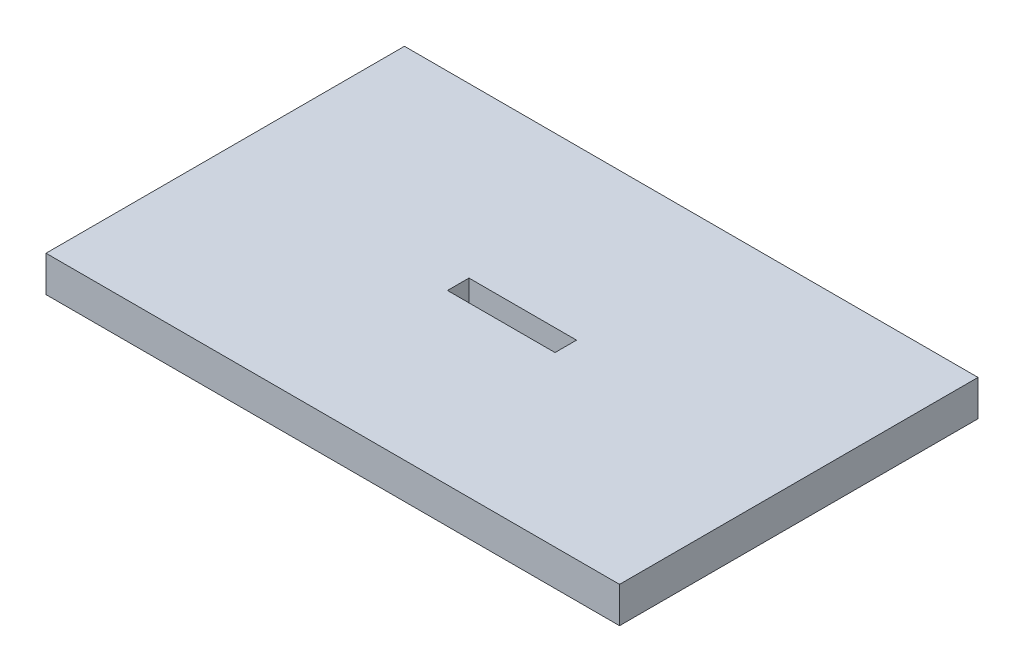
ISO-10303-21;
HEADER;
FILE_DESCRIPTION(('STEP AP214'),'2;1');
FILE_NAME('part.step','',(''),(''),'','','');
FILE_SCHEMA(('AUTOMOTIVE_DESIGN { 1 0 10303 214 1 1 1 1 }'));
ENDSEC;
DATA;
#1=APPLICATION_CONTEXT('core data for automotive mechanical design processes');
#2=APPLICATION_PROTOCOL_DEFINITION('international standard','automotive_design',2000,#1);
#3=PRODUCT_CONTEXT('',#1,'mechanical');
#4=PRODUCT('Part','Part','',(#3));
#5=PRODUCT_RELATED_PRODUCT_CATEGORY('part','',(#4));
#6=PRODUCT_DEFINITION_FORMATION('','',#4);
#7=PRODUCT_DEFINITION_CONTEXT('part definition',#1,'design');
#8=PRODUCT_DEFINITION('design','',#6,#7);
#9=PRODUCT_DEFINITION_SHAPE('','',#8);
#10=(LENGTH_UNIT() NAMED_UNIT(*) SI_UNIT(.MILLI.,.METRE.));
#11=(NAMED_UNIT(*) PLANE_ANGLE_UNIT() SI_UNIT($,.RADIAN.));
#12=(NAMED_UNIT(*) SI_UNIT($,.STERADIAN.) SOLID_ANGLE_UNIT());
#13=UNCERTAINTY_MEASURE_WITH_UNIT(LENGTH_MEASURE(1.E-05),#10,'distance_accuracy_value','');
#14=(GEOMETRIC_REPRESENTATION_CONTEXT(3) GLOBAL_UNCERTAINTY_ASSIGNED_CONTEXT((#13)) GLOBAL_UNIT_ASSIGNED_CONTEXT((#10,
#11,#12)) REPRESENTATION_CONTEXT('',''));
#15=CARTESIAN_POINT('',(0.,0.,0.));
#16=DIRECTION('',(0.,0.,1.));
#17=DIRECTION('',(1.,0.,0.));
#18=AXIS2_PLACEMENT_3D('',#15,#16,#17);
#19=CARTESIAN_POINT('',(0.,10.,0.));
#20=DIRECTION('',(0.,-1.,0.));
#21=DIRECTION('',(0.,0.,-1.));
#22=AXIS2_PLACEMENT_3D('',#19,#20,#21);
#23=PLANE('',#22);
#24=DIRECTION('',(0.,0.,-1.));
#25=VECTOR('',#24,1.);
#26=CARTESIAN_POINT('',(80.,10.,50.));
#27=LINE('',#26,#25);
#28=CARTESIAN_POINT('',(80.,10.,50.));
#29=VERTEX_POINT('',#28);
#30=CARTESIAN_POINT('',(80.,10.,-50.));
#31=VERTEX_POINT('',#30);
#32=EDGE_CURVE('E135',#29,#31,#27,.T.);
#33=ORIENTED_EDGE('',*,*,#32,.T.);
#34=DIRECTION('',(-1.,0.,0.));
#35=VECTOR('',#34,1.);
#36=CARTESIAN_POINT('',(-80.,10.,-50.));
#37=LINE('',#36,#35);
#38=CARTESIAN_POINT('',(-80.,10.,-50.));
#39=VERTEX_POINT('',#38);
#40=EDGE_CURVE('E138',#31,#39,#37,.T.);
#41=ORIENTED_EDGE('',*,*,#40,.T.);
#42=DIRECTION('',(0.,0.,1.));
#43=VECTOR('',#42,1.);
#44=CARTESIAN_POINT('',(-80.,10.,50.));
#45=LINE('',#44,#43);
#46=CARTESIAN_POINT('',(-80.,10.,50.));
#47=VERTEX_POINT('',#46);
#48=EDGE_CURVE('E141',#39,#47,#45,.T.);
#49=ORIENTED_EDGE('',*,*,#48,.T.);
#50=DIRECTION('',(1.,0.,0.));
#51=VECTOR('',#50,1.);
#52=CARTESIAN_POINT('',(-80.,10.,50.));
#53=LINE('',#52,#51);
#54=EDGE_CURVE('E143',#47,#29,#53,.T.);
#55=ORIENTED_EDGE('',*,*,#54,.T.);
#56=EDGE_LOOP('',(#33,#41,#49,#55));
#57=FACE_BOUND('',#56,.T.);
#58=DIRECTION('',(0.,0.,-1.));
#59=VECTOR('',#58,1.);
#60=CARTESIAN_POINT('',(15.,10.,3.));
#61=LINE('',#60,#59);
#62=CARTESIAN_POINT('',(15.,10.,3.));
#63=VERTEX_POINT('',#62);
#64=CARTESIAN_POINT('',(15.,10.,-3.));
#65=VERTEX_POINT('',#64);
#66=EDGE_CURVE('E99',#63,#65,#61,.T.);
#67=ORIENTED_EDGE('',*,*,#66,.F.);
#68=DIRECTION('',(1.,0.,0.));
#69=VECTOR('',#68,1.);
#70=CARTESIAN_POINT('',(-15.,10.,3.));
#71=LINE('',#70,#69);
#72=CARTESIAN_POINT('',(-15.,10.,3.));
#73=VERTEX_POINT('',#72);
#74=EDGE_CURVE('E121',#73,#63,#71,.T.);
#75=ORIENTED_EDGE('',*,*,#74,.F.);
#76=DIRECTION('',(0.,0.,1.));
#77=VECTOR('',#76,1.);
#78=CARTESIAN_POINT('',(-15.,10.,3.));
#79=LINE('',#78,#77);
#80=CARTESIAN_POINT('',(-15.,10.,-3.));
#81=VERTEX_POINT('',#80);
#82=EDGE_CURVE('E119',#81,#73,#79,.T.);
#83=ORIENTED_EDGE('',*,*,#82,.F.);
#84=DIRECTION('',(-1.,0.,0.));
#85=VECTOR('',#84,1.);
#86=CARTESIAN_POINT('',(-15.,10.,-3.));
#87=LINE('',#86,#85);
#88=EDGE_CURVE('E107',#65,#81,#87,.T.);
#89=ORIENTED_EDGE('',*,*,#88,.F.);
#90=EDGE_LOOP('',(#67,#75,#83,#89));
#91=FACE_BOUND('',#90,.T.);
#92=ADVANCED_FACE('F34',(#57,#91),#23,.F.);
#93=CARTESIAN_POINT('',(0.,0.,0.));
#94=DIRECTION('',(0.,-1.,0.));
#95=DIRECTION('',(0.,0.,-1.));
#96=AXIS2_PLACEMENT_3D('',#93,#94,#95);
#97=PLANE('',#96);
#98=DIRECTION('',(0.,0.,-1.));
#99=VECTOR('',#98,1.);
#100=CARTESIAN_POINT('',(80.,0.,50.));
#101=LINE('',#100,#99);
#102=CARTESIAN_POINT('',(80.,0.,50.));
#103=VERTEX_POINT('',#102);
#104=CARTESIAN_POINT('',(80.,0.,-50.));
#105=VERTEX_POINT('',#104);
#106=EDGE_CURVE('E115',#103,#105,#101,.T.);
#107=ORIENTED_EDGE('',*,*,#106,.F.);
#108=DIRECTION('',(1.,0.,0.));
#109=VECTOR('',#108,1.);
#110=CARTESIAN_POINT('',(-80.,0.,50.));
#111=LINE('',#110,#109);
#112=CARTESIAN_POINT('',(-80.,0.,50.));
#113=VERTEX_POINT('',#112);
#114=EDGE_CURVE('E139',#113,#103,#111,.T.);
#115=ORIENTED_EDGE('',*,*,#114,.F.);
#116=DIRECTION('',(0.,0.,1.));
#117=VECTOR('',#116,1.);
#118=CARTESIAN_POINT('',(-80.,0.,50.));
#119=LINE('',#118,#117);
#120=CARTESIAN_POINT('',(-80.,0.,-50.));
#121=VERTEX_POINT('',#120);
#122=EDGE_CURVE('E150',#121,#113,#119,.T.);
#123=ORIENTED_EDGE('',*,*,#122,.F.);
#124=DIRECTION('',(-1.,0.,0.));
#125=VECTOR('',#124,1.);
#126=CARTESIAN_POINT('',(-80.,0.,-50.));
#127=LINE('',#126,#125);
#128=EDGE_CURVE('E148',#105,#121,#127,.T.);
#129=ORIENTED_EDGE('',*,*,#128,.F.);
#130=EDGE_LOOP('',(#107,#115,#123,#129));
#131=FACE_BOUND('',#130,.T.);
#132=DIRECTION('',(1.,0.,0.));
#133=VECTOR('',#132,1.);
#134=CARTESIAN_POINT('',(-15.,0.,3.));
#135=LINE('',#134,#133);
#136=CARTESIAN_POINT('',(-15.,0.,3.));
#137=VERTEX_POINT('',#136);
#138=CARTESIAN_POINT('',(15.,0.,3.));
#139=VERTEX_POINT('',#138);
#140=EDGE_CURVE('E108',#137,#139,#135,.T.);
#141=ORIENTED_EDGE('',*,*,#140,.T.);
#142=DIRECTION('',(0.,0.,-1.));
#143=VECTOR('',#142,1.);
#144=CARTESIAN_POINT('',(15.,0.,3.));
#145=LINE('',#144,#143);
#146=CARTESIAN_POINT('',(15.,0.,-3.));
#147=VERTEX_POINT('',#146);
#148=EDGE_CURVE('E57',#139,#147,#145,.T.);
#149=ORIENTED_EDGE('',*,*,#148,.T.);
#150=DIRECTION('',(-1.,0.,0.));
#151=VECTOR('',#150,1.);
#152=CARTESIAN_POINT('',(-15.,0.,-3.));
#153=LINE('',#152,#151);
#154=CARTESIAN_POINT('',(-15.,0.,-3.));
#155=VERTEX_POINT('',#154);
#156=EDGE_CURVE('E114',#147,#155,#153,.T.);
#157=ORIENTED_EDGE('',*,*,#156,.T.);
#158=DIRECTION('',(0.,0.,1.));
#159=VECTOR('',#158,1.);
#160=CARTESIAN_POINT('',(-15.,0.,3.));
#161=LINE('',#160,#159);
#162=EDGE_CURVE('E127',#155,#137,#161,.T.);
#163=ORIENTED_EDGE('',*,*,#162,.T.);
#164=EDGE_LOOP('',(#141,#149,#157,#163));
#165=FACE_BOUND('',#164,.T.);
#166=ADVANCED_FACE('F168',(#131,#165),#97,.T.);
#167=CARTESIAN_POINT('',(80.,10.,50.));
#168=DIRECTION('',(-1.,0.,0.));
#169=DIRECTION('',(0.,0.,1.));
#170=AXIS2_PLACEMENT_3D('',#167,#168,#169);
#171=PLANE('',#170);
#172=ORIENTED_EDGE('',*,*,#106,.T.);
#173=DIRECTION('',(0.,-1.,0.));
#174=VECTOR('',#173,1.);
#175=CARTESIAN_POINT('',(80.,10.,-50.));
#176=LINE('',#175,#174);
#177=EDGE_CURVE('E11',#31,#105,#176,.T.);
#178=ORIENTED_EDGE('',*,*,#177,.F.);
#179=ORIENTED_EDGE('',*,*,#32,.F.);
#180=DIRECTION('',(0.,-1.,0.));
#181=VECTOR('',#180,1.);
#182=CARTESIAN_POINT('',(80.,10.,50.));
#183=LINE('',#182,#181);
#184=EDGE_CURVE('E145',#29,#103,#183,.T.);
#185=ORIENTED_EDGE('',*,*,#184,.T.);
#186=EDGE_LOOP('',(#172,#178,#179,#185));
#187=FACE_BOUND('',#186,.T.);
#188=ADVANCED_FACE('F36',(#187),#171,.F.);
#189=CARTESIAN_POINT('',(-80.,10.,-50.));
#190=DIRECTION('',(0.,0.,1.));
#191=DIRECTION('',(1.,0.,0.));
#192=AXIS2_PLACEMENT_3D('',#189,#190,#191);
#193=PLANE('',#192);
#194=ORIENTED_EDGE('',*,*,#128,.T.);
#195=DIRECTION('',(0.,-1.,0.));
#196=VECTOR('',#195,1.);
#197=CARTESIAN_POINT('',(-80.,10.,-50.));
#198=LINE('',#197,#196);
#199=EDGE_CURVE('E42',#39,#121,#198,.T.);
#200=ORIENTED_EDGE('',*,*,#199,.F.);
#201=ORIENTED_EDGE('',*,*,#40,.F.);
#202=ORIENTED_EDGE('',*,*,#177,.T.);
#203=EDGE_LOOP('',(#194,#200,#201,#202));
#204=FACE_BOUND('',#203,.T.);
#205=ADVANCED_FACE('F178',(#204),#193,.F.);
#206=CARTESIAN_POINT('',(-80.,10.,50.));
#207=DIRECTION('',(1.,0.,0.));
#208=DIRECTION('',(0.,0.,-1.));
#209=AXIS2_PLACEMENT_3D('',#206,#207,#208);
#210=PLANE('',#209);
#211=ORIENTED_EDGE('',*,*,#122,.T.);
#212=DIRECTION('',(0.,-1.,0.));
#213=VECTOR('',#212,1.);
#214=CARTESIAN_POINT('',(-80.,10.,50.));
#215=LINE('',#214,#213);
#216=EDGE_CURVE('E155',#47,#113,#215,.T.);
#217=ORIENTED_EDGE('',*,*,#216,.F.);
#218=ORIENTED_EDGE('',*,*,#48,.F.);
#219=ORIENTED_EDGE('',*,*,#199,.T.);
#220=EDGE_LOOP('',(#211,#217,#218,#219));
#221=FACE_BOUND('',#220,.T.);
#222=ADVANCED_FACE('F162',(#221),#210,.F.);
#223=CARTESIAN_POINT('',(-80.,10.,50.));
#224=DIRECTION('',(0.,0.,-1.));
#225=DIRECTION('',(-1.,0.,0.));
#226=AXIS2_PLACEMENT_3D('',#223,#224,#225);
#227=PLANE('',#226);
#228=ORIENTED_EDGE('',*,*,#114,.T.);
#229=ORIENTED_EDGE('',*,*,#184,.F.);
#230=ORIENTED_EDGE('',*,*,#54,.F.);
#231=ORIENTED_EDGE('',*,*,#216,.T.);
#232=EDGE_LOOP('',(#228,#229,#230,#231));
#233=FACE_BOUND('',#232,.T.);
#234=ADVANCED_FACE('F172',(#233),#227,.F.);
#235=CARTESIAN_POINT('',(15.,10.,3.));
#236=DIRECTION('',(-1.,0.,0.));
#237=DIRECTION('',(0.,0.,1.));
#238=AXIS2_PLACEMENT_3D('',#235,#236,#237);
#239=PLANE('',#238);
#240=ORIENTED_EDGE('',*,*,#148,.F.);
#241=DIRECTION('',(0.,-1.,0.));
#242=VECTOR('',#241,1.);
#243=CARTESIAN_POINT('',(15.,10.,3.));
#244=LINE('',#243,#242);
#245=EDGE_CURVE('E103',#63,#139,#244,.T.);
#246=ORIENTED_EDGE('',*,*,#245,.F.);
#247=ORIENTED_EDGE('',*,*,#66,.T.);
#248=DIRECTION('',(0.,-1.,0.));
#249=VECTOR('',#248,1.);
#250=CARTESIAN_POINT('',(15.,10.,-3.));
#251=LINE('',#250,#249);
#252=EDGE_CURVE('E102',#65,#147,#251,.T.);
#253=ORIENTED_EDGE('',*,*,#252,.T.);
#254=EDGE_LOOP('',(#240,#246,#247,#253));
#255=FACE_BOUND('',#254,.T.);
#256=ADVANCED_FACE('F101',(#255),#239,.T.);
#257=CARTESIAN_POINT('',(-15.,10.,-3.));
#258=DIRECTION('',(0.,0.,1.));
#259=DIRECTION('',(1.,0.,0.));
#260=AXIS2_PLACEMENT_3D('',#257,#258,#259);
#261=PLANE('',#260);
#262=ORIENTED_EDGE('',*,*,#156,.F.);
#263=ORIENTED_EDGE('',*,*,#252,.F.);
#264=ORIENTED_EDGE('',*,*,#88,.T.);
#265=DIRECTION('',(0.,-1.,0.));
#266=VECTOR('',#265,1.);
#267=CARTESIAN_POINT('',(-15.,10.,-3.));
#268=LINE('',#267,#266);
#269=EDGE_CURVE('E116',#81,#155,#268,.T.);
#270=ORIENTED_EDGE('',*,*,#269,.T.);
#271=EDGE_LOOP('',(#262,#263,#264,#270));
#272=FACE_BOUND('',#271,.T.);
#273=ADVANCED_FACE('F111',(#272),#261,.T.);
#274=CARTESIAN_POINT('',(-15.,10.,3.));
#275=DIRECTION('',(1.,0.,0.));
#276=DIRECTION('',(0.,0.,-1.));
#277=AXIS2_PLACEMENT_3D('',#274,#275,#276);
#278=PLANE('',#277);
#279=ORIENTED_EDGE('',*,*,#162,.F.);
#280=ORIENTED_EDGE('',*,*,#269,.F.);
#281=ORIENTED_EDGE('',*,*,#82,.T.);
#282=DIRECTION('',(0.,-1.,0.));
#283=VECTOR('',#282,1.);
#284=CARTESIAN_POINT('',(-15.,10.,3.));
#285=LINE('',#284,#283);
#286=EDGE_CURVE('E49',#73,#137,#285,.T.);
#287=ORIENTED_EDGE('',*,*,#286,.T.);
#288=EDGE_LOOP('',(#279,#280,#281,#287));
#289=FACE_BOUND('',#288,.T.);
#290=ADVANCED_FACE('F201',(#289),#278,.T.);
#291=CARTESIAN_POINT('',(-15.,10.,3.));
#292=DIRECTION('',(0.,0.,-1.));
#293=DIRECTION('',(-1.,0.,0.));
#294=AXIS2_PLACEMENT_3D('',#291,#292,#293);
#295=PLANE('',#294);
#296=ORIENTED_EDGE('',*,*,#140,.F.);
#297=ORIENTED_EDGE('',*,*,#286,.F.);
#298=ORIENTED_EDGE('',*,*,#74,.T.);
#299=ORIENTED_EDGE('',*,*,#245,.T.);
#300=EDGE_LOOP('',(#296,#297,#298,#299));
#301=FACE_BOUND('',#300,.T.);
#302=ADVANCED_FACE('F205',(#301),#295,.T.);
#303=CLOSED_SHELL('',(#92,#166,#188,#205,#222,#234,#256,#273,#290,#302));
#304=MANIFOLD_SOLID_BREP('B2',#303);
#305=ADVANCED_BREP_SHAPE_REPRESENTATION('',(#18,#304),#14);
#306=SHAPE_DEFINITION_REPRESENTATION(#9,#305);
ENDSEC;
END-ISO-10303-21;
